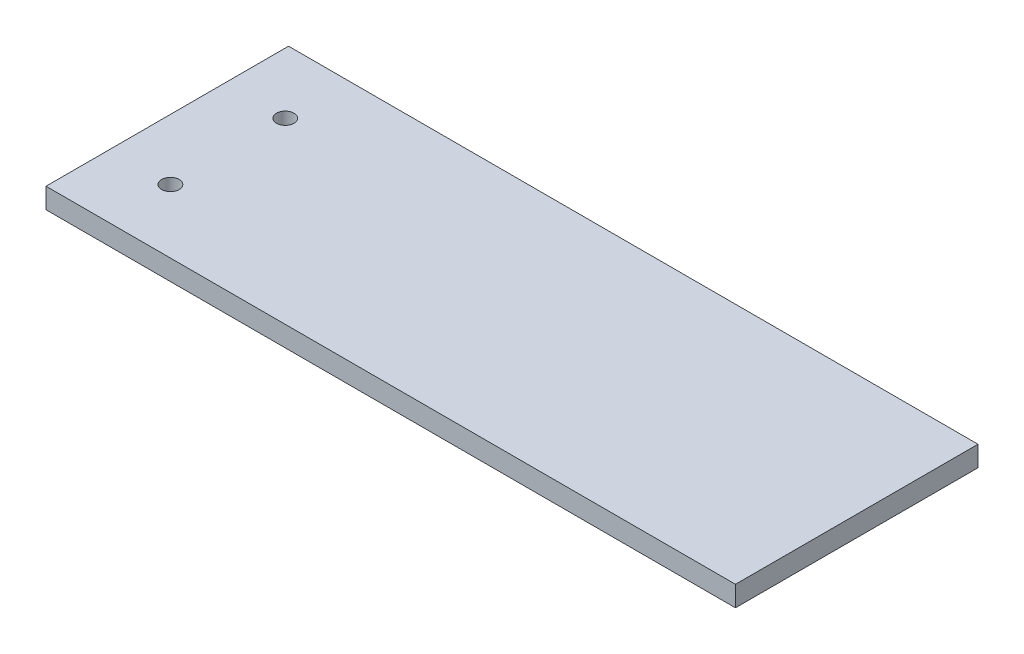
ISO-10303-21;
HEADER;
FILE_DESCRIPTION(('STEP AP214'),'2;1');
FILE_NAME('part.step','',(''),(''),'','','');
FILE_SCHEMA(('AUTOMOTIVE_DESIGN { 1 0 10303 214 1 1 1 1 }'));
ENDSEC;
DATA;
#1=APPLICATION_CONTEXT('core data for automotive mechanical design processes');
#2=APPLICATION_PROTOCOL_DEFINITION('international standard','automotive_design',2000,#1);
#3=PRODUCT_CONTEXT('',#1,'mechanical');
#4=PRODUCT('Part','Part','',(#3));
#5=PRODUCT_RELATED_PRODUCT_CATEGORY('part','',(#4));
#6=PRODUCT_DEFINITION_FORMATION('','',#4);
#7=PRODUCT_DEFINITION_CONTEXT('part definition',#1,'design');
#8=PRODUCT_DEFINITION('design','',#6,#7);
#9=PRODUCT_DEFINITION_SHAPE('','',#8);
#10=(LENGTH_UNIT() NAMED_UNIT(*) SI_UNIT(.MILLI.,.METRE.));
#11=(NAMED_UNIT(*) PLANE_ANGLE_UNIT() SI_UNIT($,.RADIAN.));
#12=(NAMED_UNIT(*) SI_UNIT($,.STERADIAN.) SOLID_ANGLE_UNIT());
#13=UNCERTAINTY_MEASURE_WITH_UNIT(LENGTH_MEASURE(1.E-05),#10,'distance_accuracy_value','');
#14=(GEOMETRIC_REPRESENTATION_CONTEXT(3) GLOBAL_UNCERTAINTY_ASSIGNED_CONTEXT((#13)) GLOBAL_UNIT_ASSIGNED_CONTEXT((#10,
#11,#12)) REPRESENTATION_CONTEXT('',''));
#15=CARTESIAN_POINT('',(0.,0.,0.));
#16=DIRECTION('',(0.,0.,1.));
#17=DIRECTION('',(1.,0.,0.));
#18=AXIS2_PLACEMENT_3D('',#15,#16,#17);
#19=CARTESIAN_POINT('',(-22.7104724821743,6.4,14.0632913414877));
#20=DIRECTION('',(1.,0.,0.));
#21=DIRECTION('',(0.,0.,-1.));
#22=AXIS2_PLACEMENT_3D('',#19,#20,#21);
#23=PLANE('',#22);
#24=DIRECTION('',(0.,0.,1.));
#25=VECTOR('',#24,1.);
#26=CARTESIAN_POINT('',(-22.7104724821743,0.,14.0632913414877));
#27=LINE('',#26,#25);
#28=CARTESIAN_POINT('',(-22.7104724821743,0.,-62.014577026531));
#29=VERTEX_POINT('',#28);
#30=CARTESIAN_POINT('',(-22.7104724821743,0.,14.0632913414877));
#31=VERTEX_POINT('',#30);
#32=EDGE_CURVE('E106',#29,#31,#27,.T.);
#33=ORIENTED_EDGE('',*,*,#32,.T.);
#34=DIRECTION('',(0.,-1.,0.));
#35=VECTOR('',#34,1.);
#36=CARTESIAN_POINT('',(-22.7104724821743,6.4,14.0632913414877));
#37=LINE('',#36,#35);
#38=CARTESIAN_POINT('',(-22.7104724821743,6.4,14.0632913414877));
#39=VERTEX_POINT('',#38);
#40=EDGE_CURVE('E11',#39,#31,#37,.T.);
#41=ORIENTED_EDGE('',*,*,#40,.F.);
#42=DIRECTION('',(0.,0.,1.));
#43=VECTOR('',#42,1.);
#44=CARTESIAN_POINT('',(-22.7104724821743,6.4,14.0632913414877));
#45=LINE('',#44,#43);
#46=CARTESIAN_POINT('',(-22.7104724821743,6.4,-62.014577026531));
#47=VERTEX_POINT('',#46);
#48=EDGE_CURVE('E90',#47,#39,#45,.T.);
#49=ORIENTED_EDGE('',*,*,#48,.F.);
#50=DIRECTION('',(0.,-1.,0.));
#51=VECTOR('',#50,1.);
#52=CARTESIAN_POINT('',(-22.7104724821743,6.4,-62.014577026531));
#53=LINE('',#52,#51);
#54=EDGE_CURVE('E102',#47,#29,#53,.T.);
#55=ORIENTED_EDGE('',*,*,#54,.T.);
#56=EDGE_LOOP('',(#33,#41,#49,#55));
#57=FACE_BOUND('',#56,.T.);
#58=ADVANCED_FACE('F38',(#57),#23,.F.);
#59=CARTESIAN_POINT('',(-22.7104724821743,6.4,14.0632913414877));
#60=DIRECTION('',(0.,0.,-1.));
#61=DIRECTION('',(-1.,0.,0.));
#62=AXIS2_PLACEMENT_3D('',#59,#60,#61);
#63=PLANE('',#62);
#64=DIRECTION('',(1.,0.,0.));
#65=VECTOR('',#64,1.);
#66=CARTESIAN_POINT('',(-22.7104724821743,0.,14.0632913414877));
#67=LINE('',#66,#65);
#68=CARTESIAN_POINT('',(193.546005421154,0.,14.0632913414877));
#69=VERTEX_POINT('',#68);
#70=EDGE_CURVE('E95',#31,#69,#67,.T.);
#71=ORIENTED_EDGE('',*,*,#70,.T.);
#72=DIRECTION('',(0.,-1.,0.));
#73=VECTOR('',#72,1.);
#74=CARTESIAN_POINT('',(193.546005421154,6.4,14.0632913414877));
#75=LINE('',#74,#73);
#76=CARTESIAN_POINT('',(193.546005421154,6.4,14.0632913414877));
#77=VERTEX_POINT('',#76);
#78=EDGE_CURVE('E47',#77,#69,#75,.T.);
#79=ORIENTED_EDGE('',*,*,#78,.F.);
#80=DIRECTION('',(1.,0.,0.));
#81=VECTOR('',#80,1.);
#82=CARTESIAN_POINT('',(-22.7104724821743,6.4,14.0632913414877));
#83=LINE('',#82,#81);
#84=EDGE_CURVE('E85',#39,#77,#83,.T.);
#85=ORIENTED_EDGE('',*,*,#84,.F.);
#86=ORIENTED_EDGE('',*,*,#40,.T.);
#87=EDGE_LOOP('',(#71,#79,#85,#86));
#88=FACE_BOUND('',#87,.T.);
#89=ADVANCED_FACE('F94',(#88),#63,.F.);
#90=CARTESIAN_POINT('',(193.546005421154,6.4,14.0632913414877));
#91=DIRECTION('',(-1.,0.,0.));
#92=DIRECTION('',(0.,0.,1.));
#93=AXIS2_PLACEMENT_3D('',#90,#91,#92);
#94=PLANE('',#93);
#95=DIRECTION('',(0.,0.,-1.));
#96=VECTOR('',#95,1.);
#97=CARTESIAN_POINT('',(193.546005421154,0.,14.0632913414877));
#98=LINE('',#97,#96);
#99=CARTESIAN_POINT('',(193.546005421154,0.,-62.014577026531));
#100=VERTEX_POINT('',#99);
#101=EDGE_CURVE('E72',#69,#100,#98,.T.);
#102=ORIENTED_EDGE('',*,*,#101,.T.);
#103=DIRECTION('',(0.,-1.,0.));
#104=VECTOR('',#103,1.);
#105=CARTESIAN_POINT('',(193.546005421154,6.4,-62.014577026531));
#106=LINE('',#105,#104);
#107=CARTESIAN_POINT('',(193.546005421154,6.4,-62.014577026531));
#108=VERTEX_POINT('',#107);
#109=EDGE_CURVE('E97',#108,#100,#106,.T.);
#110=ORIENTED_EDGE('',*,*,#109,.F.);
#111=DIRECTION('',(0.,0.,-1.));
#112=VECTOR('',#111,1.);
#113=CARTESIAN_POINT('',(193.546005421154,6.4,14.0632913414877));
#114=LINE('',#113,#112);
#115=EDGE_CURVE('E88',#77,#108,#114,.T.);
#116=ORIENTED_EDGE('',*,*,#115,.F.);
#117=ORIENTED_EDGE('',*,*,#78,.T.);
#118=EDGE_LOOP('',(#102,#110,#116,#117));
#119=FACE_BOUND('',#118,.T.);
#120=ADVANCED_FACE('F98',(#119),#94,.F.);
#121=CARTESIAN_POINT('',(-22.7104724821743,6.4,-62.014577026531));
#122=DIRECTION('',(0.,0.,1.));
#123=DIRECTION('',(1.,0.,0.));
#124=AXIS2_PLACEMENT_3D('',#121,#122,#123);
#125=PLANE('',#124);
#126=DIRECTION('',(-1.,0.,0.));
#127=VECTOR('',#126,1.);
#128=CARTESIAN_POINT('',(-22.7104724821743,0.,-62.014577026531));
#129=LINE('',#128,#127);
#130=EDGE_CURVE('E78',#100,#29,#129,.T.);
#131=ORIENTED_EDGE('',*,*,#130,.T.);
#132=ORIENTED_EDGE('',*,*,#54,.F.);
#133=DIRECTION('',(-1.,0.,0.));
#134=VECTOR('',#133,1.);
#135=CARTESIAN_POINT('',(-22.7104724821743,6.4,-62.014577026531));
#136=LINE('',#135,#134);
#137=EDGE_CURVE('E55',#108,#47,#136,.T.);
#138=ORIENTED_EDGE('',*,*,#137,.F.);
#139=ORIENTED_EDGE('',*,*,#109,.T.);
#140=EDGE_LOOP('',(#131,#132,#138,#139));
#141=FACE_BOUND('',#140,.T.);
#142=ADVANCED_FACE('F120',(#141),#125,.F.);
#143=CARTESIAN_POINT('',(0.,6.4,0.));
#144=DIRECTION('',(0.,-1.,0.));
#145=DIRECTION('',(0.,0.,-1.));
#146=AXIS2_PLACEMENT_3D('',#143,#144,#145);
#147=PLANE('',#146);
#148=CARTESIAN_POINT('',(-3.66047248217427,6.4,-5.914577026531));
#149=DIRECTION('',(0.,-1.,0.));
#150=DIRECTION('',(0.,0.,-1.));
#151=AXIS2_PLACEMENT_3D('',#148,#149,#150);
#152=CIRCLE('',#151,2.75);
#153=CARTESIAN_POINT('',(-3.66047248217427,6.4,-8.664577026531));
#154=VERTEX_POINT('',#153);
#155=EDGE_CURVE('E110',#154,#154,#152,.T.);
#156=ORIENTED_EDGE('',*,*,#155,.T.);
#157=EDGE_LOOP('',(#156));
#158=FACE_BOUND('',#157,.T.);
#159=CARTESIAN_POINT('',(-3.66047248217428,6.4,-41.914577026531));
#160=DIRECTION('',(0.,-1.,0.));
#161=DIRECTION('',(0.,0.,-1.));
#162=AXIS2_PLACEMENT_3D('',#159,#160,#161);
#163=CIRCLE('',#162,2.75);
#164=CARTESIAN_POINT('',(-3.66047248217428,6.4,-44.664577026531));
#165=VERTEX_POINT('',#164);
#166=EDGE_CURVE('E130',#165,#165,#163,.T.);
#167=ORIENTED_EDGE('',*,*,#166,.T.);
#168=EDGE_LOOP('',(#167));
#169=FACE_BOUND('',#168,.T.);
#170=ORIENTED_EDGE('',*,*,#48,.T.);
#171=ORIENTED_EDGE('',*,*,#84,.T.);
#172=ORIENTED_EDGE('',*,*,#115,.T.);
#173=ORIENTED_EDGE('',*,*,#137,.T.);
#174=EDGE_LOOP('',(#170,#171,#172,#173));
#175=FACE_BOUND('',#174,.T.);
#176=ADVANCED_FACE('F86',(#158,#169,#175),#147,.F.);
#177=CARTESIAN_POINT('',(0.,0.,0.));
#178=DIRECTION('',(0.,-1.,0.));
#179=DIRECTION('',(0.,0.,-1.));
#180=AXIS2_PLACEMENT_3D('',#177,#178,#179);
#181=PLANE('',#180);
#182=CARTESIAN_POINT('',(-3.66047248217427,0.,-5.914577026531));
#183=DIRECTION('',(0.,-1.,0.));
#184=DIRECTION('',(0.,0.,-1.));
#185=AXIS2_PLACEMENT_3D('',#182,#183,#184);
#186=CIRCLE('',#185,2.75);
#187=CARTESIAN_POINT('',(-3.66047248217427,0.,-8.664577026531));
#188=VERTEX_POINT('',#187);
#189=EDGE_CURVE('E134',#188,#188,#186,.T.);
#190=ORIENTED_EDGE('',*,*,#189,.F.);
#191=EDGE_LOOP('',(#190));
#192=FACE_BOUND('',#191,.T.);
#193=CARTESIAN_POINT('',(-3.66047248217428,0.,-41.914577026531));
#194=DIRECTION('',(0.,-1.,0.));
#195=DIRECTION('',(0.,0.,-1.));
#196=AXIS2_PLACEMENT_3D('',#193,#194,#195);
#197=CIRCLE('',#196,2.75);
#198=CARTESIAN_POINT('',(-3.66047248217428,0.,-44.664577026531));
#199=VERTEX_POINT('',#198);
#200=EDGE_CURVE('E135',#199,#199,#197,.T.);
#201=ORIENTED_EDGE('',*,*,#200,.F.);
#202=EDGE_LOOP('',(#201));
#203=FACE_BOUND('',#202,.T.);
#204=ORIENTED_EDGE('',*,*,#32,.F.);
#205=ORIENTED_EDGE('',*,*,#130,.F.);
#206=ORIENTED_EDGE('',*,*,#101,.F.);
#207=ORIENTED_EDGE('',*,*,#70,.F.);
#208=EDGE_LOOP('',(#204,#205,#206,#207));
#209=FACE_BOUND('',#208,.T.);
#210=ADVANCED_FACE('F123',(#192,#203,#209),#181,.T.);
#211=CARTESIAN_POINT('',(-3.66047248217428,10.,-41.914577026531));
#212=DIRECTION('',(0.,-1.,0.));
#213=DIRECTION('',(0.,0.,-1.));
#214=AXIS2_PLACEMENT_3D('',#211,#212,#213);
#215=CYLINDRICAL_SURFACE('',#214,2.75);
#216=ORIENTED_EDGE('',*,*,#200,.T.);
#217=EDGE_LOOP('',(#216));
#218=FACE_BOUND('',#217,.T.);
#219=ORIENTED_EDGE('',*,*,#166,.F.);
#220=EDGE_LOOP('',(#219));
#221=FACE_BOUND('',#220,.T.);
#222=ADVANCED_FACE('F148',(#218,#221),#215,.F.);
#223=CARTESIAN_POINT('',(-3.66047248217427,10.,-5.914577026531));
#224=DIRECTION('',(0.,-1.,0.));
#225=DIRECTION('',(0.,0.,-1.));
#226=AXIS2_PLACEMENT_3D('',#223,#224,#225);
#227=CYLINDRICAL_SURFACE('',#226,2.75);
#228=ORIENTED_EDGE('',*,*,#189,.T.);
#229=EDGE_LOOP('',(#228));
#230=FACE_BOUND('',#229,.T.);
#231=ORIENTED_EDGE('',*,*,#155,.F.);
#232=EDGE_LOOP('',(#231));
#233=FACE_BOUND('',#232,.T.);
#234=ADVANCED_FACE('F143',(#230,#233),#227,.F.);
#235=CLOSED_SHELL('',(#58,#89,#120,#142,#176,#210,#222,#234));
#236=MANIFOLD_SOLID_BREP('B2',#235);
#237=ADVANCED_BREP_SHAPE_REPRESENTATION('',(#18,#236),#14);
#238=SHAPE_DEFINITION_REPRESENTATION(#9,#237);
ENDSEC;
END-ISO-10303-21;
